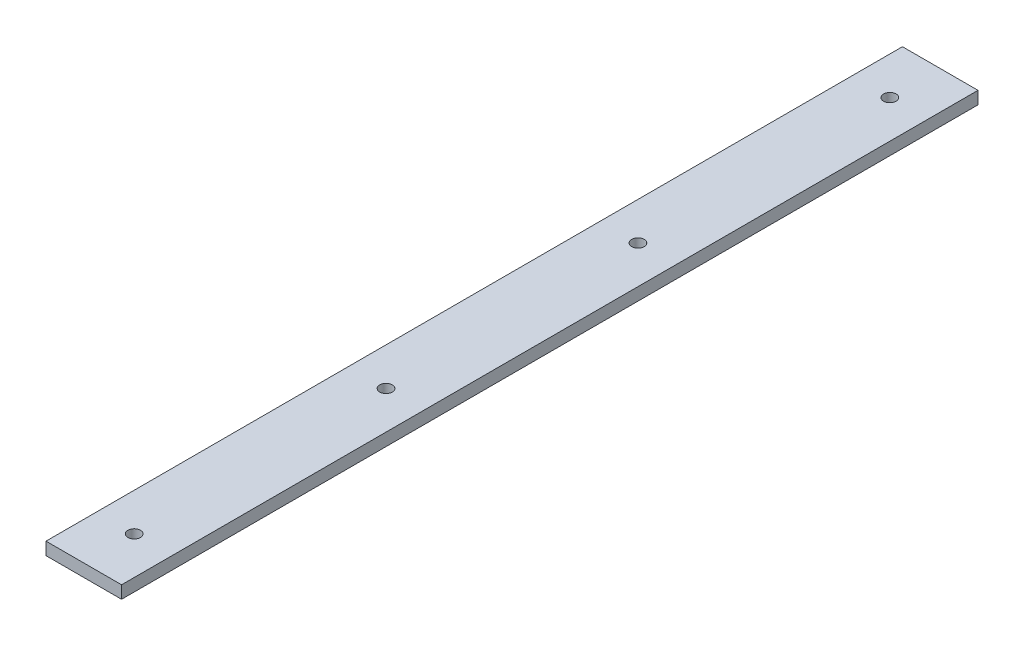
ISO-10303-21;
HEADER;
FILE_DESCRIPTION(('STEP AP214'),'2;1');
FILE_NAME('part.step','',(''),(''),'','','');
FILE_SCHEMA(('AUTOMOTIVE_DESIGN { 1 0 10303 214 1 1 1 1 }'));
ENDSEC;
DATA;
#1=APPLICATION_CONTEXT('core data for automotive mechanical design processes');
#2=APPLICATION_PROTOCOL_DEFINITION('international standard','automotive_design',2000,#1);
#3=PRODUCT_CONTEXT('',#1,'mechanical');
#4=PRODUCT('Part','Part','',(#3));
#5=PRODUCT_RELATED_PRODUCT_CATEGORY('part','',(#4));
#6=PRODUCT_DEFINITION_FORMATION('','',#4);
#7=PRODUCT_DEFINITION_CONTEXT('part definition',#1,'design');
#8=PRODUCT_DEFINITION('design','',#6,#7);
#9=PRODUCT_DEFINITION_SHAPE('','',#8);
#10=(LENGTH_UNIT() NAMED_UNIT(*) SI_UNIT(.MILLI.,.METRE.));
#11=(NAMED_UNIT(*) PLANE_ANGLE_UNIT() SI_UNIT($,.RADIAN.));
#12=(NAMED_UNIT(*) SI_UNIT($,.STERADIAN.) SOLID_ANGLE_UNIT());
#13=UNCERTAINTY_MEASURE_WITH_UNIT(LENGTH_MEASURE(1.E-05),#10,'distance_accuracy_value','');
#14=(GEOMETRIC_REPRESENTATION_CONTEXT(3) GLOBAL_UNCERTAINTY_ASSIGNED_CONTEXT((#13)) GLOBAL_UNIT_ASSIGNED_CONTEXT((#10,
#11,#12)) REPRESENTATION_CONTEXT('',''));
#15=CARTESIAN_POINT('',(0.,0.,0.));
#16=DIRECTION('',(0.,0.,1.));
#17=DIRECTION('',(1.,0.,0.));
#18=AXIS2_PLACEMENT_3D('',#15,#16,#17);
#19=CARTESIAN_POINT('',(-15.,2.5,170.));
#20=DIRECTION('',(1.,0.,0.));
#21=DIRECTION('',(0.,0.,-1.));
#22=AXIS2_PLACEMENT_3D('',#19,#20,#21);
#23=PLANE('',#22);
#24=DIRECTION('',(0.,-1.,0.));
#25=VECTOR('',#24,1.);
#26=CARTESIAN_POINT('',(-15.,2.5,-170.));
#27=LINE('',#26,#25);
#28=CARTESIAN_POINT('',(-15.,2.5,-170.));
#29=VERTEX_POINT('',#28);
#30=CARTESIAN_POINT('',(-15.,-2.5,-170.));
#31=VERTEX_POINT('',#30);
#32=EDGE_CURVE('E95',#29,#31,#27,.T.);
#33=ORIENTED_EDGE('',*,*,#32,.T.);
#34=DIRECTION('',(0.,0.,-1.));
#35=VECTOR('',#34,1.);
#36=CARTESIAN_POINT('',(-15.,-2.5,170.));
#37=LINE('',#36,#35);
#38=CARTESIAN_POINT('',(-15.,-2.5,170.));
#39=VERTEX_POINT('',#38);
#40=EDGE_CURVE('E11',#39,#31,#37,.T.);
#41=ORIENTED_EDGE('',*,*,#40,.F.);
#42=DIRECTION('',(0.,-1.,0.));
#43=VECTOR('',#42,1.);
#44=CARTESIAN_POINT('',(-15.,2.5,170.));
#45=LINE('',#44,#43);
#46=CARTESIAN_POINT('',(-15.,2.5,170.));
#47=VERTEX_POINT('',#46);
#48=EDGE_CURVE('E83',#47,#39,#45,.T.);
#49=ORIENTED_EDGE('',*,*,#48,.F.);
#50=DIRECTION('',(0.,0.,-1.));
#51=VECTOR('',#50,1.);
#52=CARTESIAN_POINT('',(-15.,2.5,170.));
#53=LINE('',#52,#51);
#54=EDGE_CURVE('E91',#47,#29,#53,.T.);
#55=ORIENTED_EDGE('',*,*,#54,.T.);
#56=EDGE_LOOP('',(#33,#41,#49,#55));
#57=FACE_BOUND('',#56,.T.);
#58=ADVANCED_FACE('F32',(#57),#23,.F.);
#59=CARTESIAN_POINT('',(-15.,-2.5,170.));
#60=DIRECTION('',(0.,1.,0.));
#61=DIRECTION('',(-1.,0.,0.));
#62=AXIS2_PLACEMENT_3D('',#59,#60,#61);
#63=PLANE('',#62);
#64=CARTESIAN_POINT('',(0.,-2.5,150.));
#65=DIRECTION('',(0.,1.,0.));
#66=DIRECTION('',(-1.,0.,0.));
#67=AXIS2_PLACEMENT_3D('',#64,#65,#66);
#68=CIRCLE('',#67,2.5);
#69=CARTESIAN_POINT('',(-2.5,-2.5,150.));
#70=VERTEX_POINT('',#69);
#71=EDGE_CURVE('E112',#70,#70,#68,.T.);
#72=ORIENTED_EDGE('',*,*,#71,.T.);
#73=EDGE_LOOP('',(#72));
#74=FACE_BOUND('',#73,.T.);
#75=CARTESIAN_POINT('',(0.,-2.5,-150.));
#76=DIRECTION('',(0.,1.,0.));
#77=DIRECTION('',(1.,0.,0.));
#78=AXIS2_PLACEMENT_3D('',#75,#76,#77);
#79=CIRCLE('',#78,2.5);
#80=CARTESIAN_POINT('',(2.5,-2.5,-150.));
#81=VERTEX_POINT('',#80);
#82=EDGE_CURVE('E118',#81,#81,#79,.T.);
#83=ORIENTED_EDGE('',*,*,#82,.T.);
#84=EDGE_LOOP('',(#83));
#85=FACE_BOUND('',#84,.T.);
#86=CARTESIAN_POINT('',(0.,-2.5,-50.));
#87=DIRECTION('',(0.,1.,0.));
#88=DIRECTION('',(1.,0.,0.));
#89=AXIS2_PLACEMENT_3D('',#86,#87,#88);
#90=CIRCLE('',#89,2.5);
#91=CARTESIAN_POINT('',(2.5,-2.5,-50.));
#92=VERTEX_POINT('',#91);
#93=EDGE_CURVE('E119',#92,#92,#90,.T.);
#94=ORIENTED_EDGE('',*,*,#93,.T.);
#95=EDGE_LOOP('',(#94));
#96=FACE_BOUND('',#95,.T.);
#97=CARTESIAN_POINT('',(0.,-2.5,50.));
#98=DIRECTION('',(0.,1.,0.));
#99=DIRECTION('',(-1.,0.,0.));
#100=AXIS2_PLACEMENT_3D('',#97,#98,#99);
#101=CIRCLE('',#100,2.5);
#102=CARTESIAN_POINT('',(-2.5,-2.5,50.));
#103=VERTEX_POINT('',#102);
#104=EDGE_CURVE('E98',#103,#103,#101,.T.);
#105=ORIENTED_EDGE('',*,*,#104,.T.);
#106=EDGE_LOOP('',(#105));
#107=FACE_BOUND('',#106,.T.);
#108=DIRECTION('',(1.,0.,0.));
#109=VECTOR('',#108,1.);
#110=CARTESIAN_POINT('',(-15.,-2.5,-170.));
#111=LINE('',#110,#109);
#112=CARTESIAN_POINT('',(15.,-2.5,-170.));
#113=VERTEX_POINT('',#112);
#114=EDGE_CURVE('E87',#31,#113,#111,.T.);
#115=ORIENTED_EDGE('',*,*,#114,.T.);
#116=DIRECTION('',(0.,0.,-1.));
#117=VECTOR('',#116,1.);
#118=CARTESIAN_POINT('',(15.,-2.5,170.));
#119=LINE('',#118,#117);
#120=CARTESIAN_POINT('',(15.,-2.5,170.));
#121=VERTEX_POINT('',#120);
#122=EDGE_CURVE('E40',#121,#113,#119,.T.);
#123=ORIENTED_EDGE('',*,*,#122,.F.);
#124=DIRECTION('',(1.,0.,0.));
#125=VECTOR('',#124,1.);
#126=CARTESIAN_POINT('',(-15.,-2.5,170.));
#127=LINE('',#126,#125);
#128=EDGE_CURVE('E78',#39,#121,#127,.T.);
#129=ORIENTED_EDGE('',*,*,#128,.F.);
#130=ORIENTED_EDGE('',*,*,#40,.T.);
#131=EDGE_LOOP('',(#115,#123,#129,#130));
#132=FACE_BOUND('',#131,.T.);
#133=ADVANCED_FACE('F86',(#74,#85,#96,#107,#132),#63,.F.);
#134=CARTESIAN_POINT('',(15.,2.5,170.));
#135=DIRECTION('',(-1.,0.,0.));
#136=DIRECTION('',(0.,0.,1.));
#137=AXIS2_PLACEMENT_3D('',#134,#135,#136);
#138=PLANE('',#137);
#139=DIRECTION('',(0.,1.,0.));
#140=VECTOR('',#139,1.);
#141=CARTESIAN_POINT('',(15.,2.5,-170.));
#142=LINE('',#141,#140);
#143=CARTESIAN_POINT('',(15.,2.5,-170.));
#144=VERTEX_POINT('',#143);
#145=EDGE_CURVE('E65',#113,#144,#142,.T.);
#146=ORIENTED_EDGE('',*,*,#145,.T.);
#147=DIRECTION('',(0.,0.,-1.));
#148=VECTOR('',#147,1.);
#149=CARTESIAN_POINT('',(15.,2.5,170.));
#150=LINE('',#149,#148);
#151=CARTESIAN_POINT('',(15.,2.5,170.));
#152=VERTEX_POINT('',#151);
#153=EDGE_CURVE('E88',#152,#144,#150,.T.);
#154=ORIENTED_EDGE('',*,*,#153,.F.);
#155=DIRECTION('',(0.,1.,0.));
#156=VECTOR('',#155,1.);
#157=CARTESIAN_POINT('',(15.,2.5,170.));
#158=LINE('',#157,#156);
#159=EDGE_CURVE('E81',#121,#152,#158,.T.);
#160=ORIENTED_EDGE('',*,*,#159,.F.);
#161=ORIENTED_EDGE('',*,*,#122,.T.);
#162=EDGE_LOOP('',(#146,#154,#160,#161));
#163=FACE_BOUND('',#162,.T.);
#164=ADVANCED_FACE('F89',(#163),#138,.F.);
#165=CARTESIAN_POINT('',(-15.,2.5,170.));
#166=DIRECTION('',(0.,-1.,0.));
#167=DIRECTION('',(1.,0.,0.));
#168=AXIS2_PLACEMENT_3D('',#165,#166,#167);
#169=PLANE('',#168);
#170=CARTESIAN_POINT('',(0.,2.5,150.));
#171=DIRECTION('',(0.,1.,0.));
#172=DIRECTION('',(-1.,0.,0.));
#173=AXIS2_PLACEMENT_3D('',#170,#171,#172);
#174=CIRCLE('',#173,2.5);
#175=CARTESIAN_POINT('',(-2.5,2.5,150.));
#176=VERTEX_POINT('',#175);
#177=EDGE_CURVE('E122',#176,#176,#174,.T.);
#178=ORIENTED_EDGE('',*,*,#177,.F.);
#179=EDGE_LOOP('',(#178));
#180=FACE_BOUND('',#179,.T.);
#181=CARTESIAN_POINT('',(0.,2.5,-150.));
#182=DIRECTION('',(0.,1.,0.));
#183=DIRECTION('',(1.,0.,0.));
#184=AXIS2_PLACEMENT_3D('',#181,#182,#183);
#185=CIRCLE('',#184,2.5);
#186=CARTESIAN_POINT('',(2.5,2.5,-150.));
#187=VERTEX_POINT('',#186);
#188=EDGE_CURVE('E115',#187,#187,#185,.T.);
#189=ORIENTED_EDGE('',*,*,#188,.F.);
#190=EDGE_LOOP('',(#189));
#191=FACE_BOUND('',#190,.T.);
#192=CARTESIAN_POINT('',(0.,2.5,-50.));
#193=DIRECTION('',(0.,1.,0.));
#194=DIRECTION('',(1.,0.,0.));
#195=AXIS2_PLACEMENT_3D('',#192,#193,#194);
#196=CIRCLE('',#195,2.5);
#197=CARTESIAN_POINT('',(2.5,2.5,-50.));
#198=VERTEX_POINT('',#197);
#199=EDGE_CURVE('E127',#198,#198,#196,.T.);
#200=ORIENTED_EDGE('',*,*,#199,.F.);
#201=EDGE_LOOP('',(#200));
#202=FACE_BOUND('',#201,.T.);
#203=CARTESIAN_POINT('',(0.,2.5,50.));
#204=DIRECTION('',(0.,1.,0.));
#205=DIRECTION('',(-1.,0.,0.));
#206=AXIS2_PLACEMENT_3D('',#203,#204,#205);
#207=CIRCLE('',#206,2.5);
#208=CARTESIAN_POINT('',(-2.5,2.5,50.));
#209=VERTEX_POINT('',#208);
#210=EDGE_CURVE('E109',#209,#209,#207,.T.);
#211=ORIENTED_EDGE('',*,*,#210,.F.);
#212=EDGE_LOOP('',(#211));
#213=FACE_BOUND('',#212,.T.);
#214=DIRECTION('',(-1.,0.,0.));
#215=VECTOR('',#214,1.);
#216=CARTESIAN_POINT('',(-15.,2.5,-170.));
#217=LINE('',#216,#215);
#218=EDGE_CURVE('E71',#144,#29,#217,.T.);
#219=ORIENTED_EDGE('',*,*,#218,.T.);
#220=ORIENTED_EDGE('',*,*,#54,.F.);
#221=DIRECTION('',(-1.,0.,0.));
#222=VECTOR('',#221,1.);
#223=CARTESIAN_POINT('',(-15.,2.5,170.));
#224=LINE('',#223,#222);
#225=EDGE_CURVE('E48',#152,#47,#224,.T.);
#226=ORIENTED_EDGE('',*,*,#225,.F.);
#227=ORIENTED_EDGE('',*,*,#153,.T.);
#228=EDGE_LOOP('',(#219,#220,#226,#227));
#229=FACE_BOUND('',#228,.T.);
#230=ADVANCED_FACE('F103',(#180,#191,#202,#213,#229),#169,.F.);
#231=CARTESIAN_POINT('',(0.,0.,170.));
#232=DIRECTION('',(0.,0.,1.));
#233=DIRECTION('',(1.,0.,0.));
#234=AXIS2_PLACEMENT_3D('',#231,#232,#233);
#235=PLANE('',#234);
#236=ORIENTED_EDGE('',*,*,#48,.T.);
#237=ORIENTED_EDGE('',*,*,#128,.T.);
#238=ORIENTED_EDGE('',*,*,#159,.T.);
#239=ORIENTED_EDGE('',*,*,#225,.T.);
#240=EDGE_LOOP('',(#236,#237,#238,#239));
#241=FACE_BOUND('',#240,.T.);
#242=ADVANCED_FACE('F79',(#241),#235,.T.);
#243=CARTESIAN_POINT('',(0.,0.,-170.));
#244=DIRECTION('',(0.,0.,1.));
#245=DIRECTION('',(1.,0.,0.));
#246=AXIS2_PLACEMENT_3D('',#243,#244,#245);
#247=PLANE('',#246);
#248=ORIENTED_EDGE('',*,*,#32,.F.);
#249=ORIENTED_EDGE('',*,*,#218,.F.);
#250=ORIENTED_EDGE('',*,*,#145,.F.);
#251=ORIENTED_EDGE('',*,*,#114,.F.);
#252=EDGE_LOOP('',(#248,#249,#250,#251));
#253=FACE_BOUND('',#252,.T.);
#254=ADVANCED_FACE('F106',(#253),#247,.F.);
#255=CARTESIAN_POINT('',(0.,-2.5,50.));
#256=DIRECTION('',(0.,1.,0.));
#257=DIRECTION('',(-1.,0.,0.));
#258=AXIS2_PLACEMENT_3D('',#255,#256,#257);
#259=CYLINDRICAL_SURFACE('',#258,2.5);
#260=ORIENTED_EDGE('',*,*,#104,.F.);
#261=EDGE_LOOP('',(#260));
#262=FACE_BOUND('',#261,.T.);
#263=ORIENTED_EDGE('',*,*,#210,.T.);
#264=EDGE_LOOP('',(#263));
#265=FACE_BOUND('',#264,.T.);
#266=ADVANCED_FACE('F139',(#262,#265),#259,.F.);
#267=CARTESIAN_POINT('',(0.,-2.5,-50.));
#268=DIRECTION('',(0.,1.,0.));
#269=DIRECTION('',(-1.,0.,0.));
#270=AXIS2_PLACEMENT_3D('',#267,#268,#269);
#271=CYLINDRICAL_SURFACE('',#270,2.5);
#272=ORIENTED_EDGE('',*,*,#93,.F.);
#273=EDGE_LOOP('',(#272));
#274=FACE_BOUND('',#273,.T.);
#275=ORIENTED_EDGE('',*,*,#199,.T.);
#276=EDGE_LOOP('',(#275));
#277=FACE_BOUND('',#276,.T.);
#278=ADVANCED_FACE('F135',(#274,#277),#271,.F.);
#279=CARTESIAN_POINT('',(0.,-2.5,-150.));
#280=DIRECTION('',(0.,1.,0.));
#281=DIRECTION('',(-1.,0.,0.));
#282=AXIS2_PLACEMENT_3D('',#279,#280,#281);
#283=CYLINDRICAL_SURFACE('',#282,2.5);
#284=ORIENTED_EDGE('',*,*,#82,.F.);
#285=EDGE_LOOP('',(#284));
#286=FACE_BOUND('',#285,.T.);
#287=ORIENTED_EDGE('',*,*,#188,.T.);
#288=EDGE_LOOP('',(#287));
#289=FACE_BOUND('',#288,.T.);
#290=ADVANCED_FACE('F138',(#286,#289),#283,.F.);
#291=CARTESIAN_POINT('',(0.,-2.5,150.));
#292=DIRECTION('',(0.,1.,0.));
#293=DIRECTION('',(-1.,0.,0.));
#294=AXIS2_PLACEMENT_3D('',#291,#292,#293);
#295=CYLINDRICAL_SURFACE('',#294,2.5);
#296=ORIENTED_EDGE('',*,*,#71,.F.);
#297=EDGE_LOOP('',(#296));
#298=FACE_BOUND('',#297,.T.);
#299=ORIENTED_EDGE('',*,*,#177,.T.);
#300=EDGE_LOOP('',(#299));
#301=FACE_BOUND('',#300,.T.);
#302=ADVANCED_FACE('F208',(#298,#301),#295,.F.);
#303=CLOSED_SHELL('',(#58,#133,#164,#230,#242,#254,#266,#278,#290,#302));
#304=MANIFOLD_SOLID_BREP('B2',#303);
#305=ADVANCED_BREP_SHAPE_REPRESENTATION('',(#18,#304),#14);
#306=SHAPE_DEFINITION_REPRESENTATION(#9,#305);
ENDSEC;
END-ISO-10303-21;
